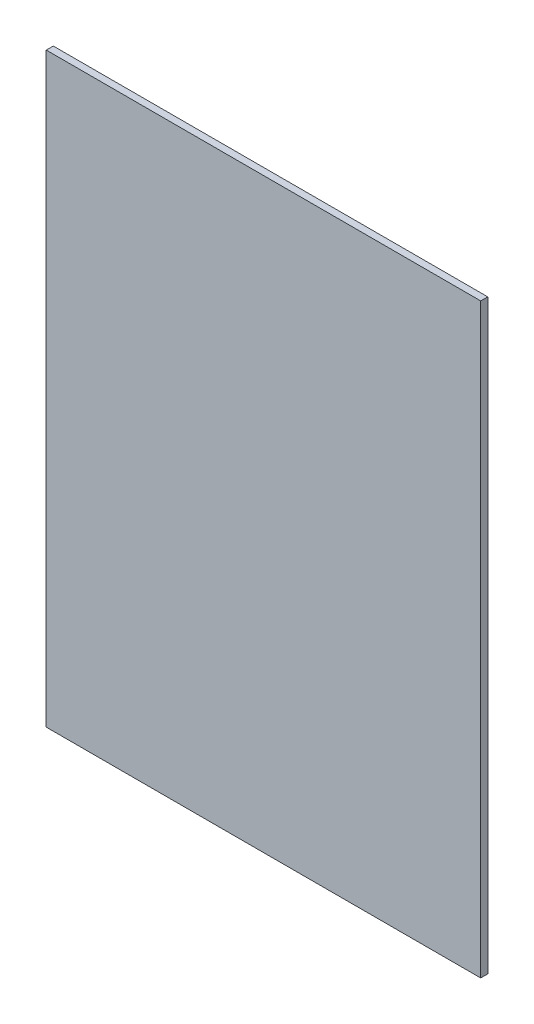
ISO-10303-21;
HEADER;
FILE_DESCRIPTION(('STEP AP214'),'2;1');
FILE_NAME('part.step','',(''),(''),'','','');
FILE_SCHEMA(('AUTOMOTIVE_DESIGN { 1 0 10303 214 1 1 1 1 }'));
ENDSEC;
DATA;
#1=APPLICATION_CONTEXT('core data for automotive mechanical design processes');
#2=APPLICATION_PROTOCOL_DEFINITION('international standard','automotive_design',2000,#1);
#3=PRODUCT_CONTEXT('',#1,'mechanical');
#4=PRODUCT('Part','Part','',(#3));
#5=PRODUCT_RELATED_PRODUCT_CATEGORY('part','',(#4));
#6=PRODUCT_DEFINITION_FORMATION('','',#4);
#7=PRODUCT_DEFINITION_CONTEXT('part definition',#1,'design');
#8=PRODUCT_DEFINITION('design','',#6,#7);
#9=PRODUCT_DEFINITION_SHAPE('','',#8);
#10=(LENGTH_UNIT() NAMED_UNIT(*) SI_UNIT(.MILLI.,.METRE.));
#11=(NAMED_UNIT(*) PLANE_ANGLE_UNIT() SI_UNIT($,.RADIAN.));
#12=(NAMED_UNIT(*) SI_UNIT($,.STERADIAN.) SOLID_ANGLE_UNIT());
#13=UNCERTAINTY_MEASURE_WITH_UNIT(LENGTH_MEASURE(1.E-05),#10,'distance_accuracy_value','');
#14=(GEOMETRIC_REPRESENTATION_CONTEXT(3) GLOBAL_UNCERTAINTY_ASSIGNED_CONTEXT((#13)) GLOBAL_UNIT_ASSIGNED_CONTEXT((#10,
#11,#12)) REPRESENTATION_CONTEXT('',''));
#15=CARTESIAN_POINT('',(0.,0.,0.));
#16=DIRECTION('',(0.,0.,1.));
#17=DIRECTION('',(1.,0.,0.));
#18=AXIS2_PLACEMENT_3D('',#15,#16,#17);
#19=CARTESIAN_POINT('',(0.,0.,1.6));
#20=DIRECTION('',(1.,0.,0.));
#21=DIRECTION('',(0.,0.,-1.));
#22=AXIS2_PLACEMENT_3D('',#19,#20,#21);
#23=PLANE('',#22);
#24=DIRECTION('',(0.,-1.,0.));
#25=VECTOR('',#24,1.);
#26=CARTESIAN_POINT('',(0.,0.,0.));
#27=LINE('',#26,#25);
#28=CARTESIAN_POINT('',(0.,133.40102225,0.));
#29=VERTEX_POINT('',#28);
#30=CARTESIAN_POINT('',(0.,0.,0.));
#31=VERTEX_POINT('',#30);
#32=EDGE_CURVE('E120',#29,#31,#27,.T.);
#33=ORIENTED_EDGE('',*,*,#32,.T.);
#34=DIRECTION('',(0.,0.,-1.));
#35=VECTOR('',#34,1.);
#36=CARTESIAN_POINT('',(0.,0.,1.6));
#37=LINE('',#36,#35);
#38=CARTESIAN_POINT('',(0.,0.,1.6));
#39=VERTEX_POINT('',#38);
#40=EDGE_CURVE('E11',#39,#31,#37,.T.);
#41=ORIENTED_EDGE('',*,*,#40,.F.);
#42=DIRECTION('',(0.,-1.,0.));
#43=VECTOR('',#42,1.);
#44=CARTESIAN_POINT('',(0.,0.,1.6));
#45=LINE('',#44,#43);
#46=CARTESIAN_POINT('',(0.,133.40102225,1.6));
#47=VERTEX_POINT('',#46);
#48=EDGE_CURVE('E102',#47,#39,#45,.T.);
#49=ORIENTED_EDGE('',*,*,#48,.F.);
#50=DIRECTION('',(0.,0.,-1.));
#51=VECTOR('',#50,1.);
#52=CARTESIAN_POINT('',(0.,133.40102225,1.6));
#53=LINE('',#52,#51);
#54=EDGE_CURVE('E116',#47,#29,#53,.T.);
#55=ORIENTED_EDGE('',*,*,#54,.T.);
#56=EDGE_LOOP('',(#33,#41,#49,#55));
#57=FACE_BOUND('',#56,.T.);
#58=ADVANCED_FACE('F49',(#57),#23,.F.);
#59=CARTESIAN_POINT('',(0.,0.,1.6));
#60=DIRECTION('',(0.,1.,0.));
#61=DIRECTION('',(0.,0.,1.));
#62=AXIS2_PLACEMENT_3D('',#59,#60,#61);
#63=PLANE('',#62);
#64=DIRECTION('',(1.,0.,0.));
#65=VECTOR('',#64,1.);
#66=CARTESIAN_POINT('',(0.,0.,0.));
#67=LINE('',#66,#65);
#68=CARTESIAN_POINT('',(98.840202878,0.,0.));
#69=VERTEX_POINT('',#68);
#70=EDGE_CURVE('E107',#31,#69,#67,.T.);
#71=ORIENTED_EDGE('',*,*,#70,.T.);
#72=DIRECTION('',(0.,0.,-1.));
#73=VECTOR('',#72,1.);
#74=CARTESIAN_POINT('',(98.840202878,0.,1.6));
#75=LINE('',#74,#73);
#76=CARTESIAN_POINT('',(98.840202878,0.,1.6));
#77=VERTEX_POINT('',#76);
#78=EDGE_CURVE('E57',#77,#69,#75,.T.);
#79=ORIENTED_EDGE('',*,*,#78,.F.);
#80=DIRECTION('',(1.,0.,0.));
#81=VECTOR('',#80,1.);
#82=CARTESIAN_POINT('',(0.,0.,1.6));
#83=LINE('',#82,#81);
#84=EDGE_CURVE('E96',#39,#77,#83,.T.);
#85=ORIENTED_EDGE('',*,*,#84,.F.);
#86=ORIENTED_EDGE('',*,*,#40,.T.);
#87=EDGE_LOOP('',(#71,#79,#85,#86));
#88=FACE_BOUND('',#87,.T.);
#89=ADVANCED_FACE('F106',(#88),#63,.F.);
#90=CARTESIAN_POINT('',(98.840202878,0.,1.6));
#91=DIRECTION('',(-1.,0.,0.));
#92=DIRECTION('',(0.,0.,1.));
#93=AXIS2_PLACEMENT_3D('',#90,#91,#92);
#94=PLANE('',#93);
#95=DIRECTION('',(0.,1.,0.));
#96=VECTOR('',#95,1.);
#97=CARTESIAN_POINT('',(98.840202878,0.,0.));
#98=LINE('',#97,#96);
#99=CARTESIAN_POINT('',(98.840202878,133.40102225,0.));
#100=VERTEX_POINT('',#99);
#101=EDGE_CURVE('E83',#69,#100,#98,.T.);
#102=ORIENTED_EDGE('',*,*,#101,.T.);
#103=DIRECTION('',(0.,0.,-1.));
#104=VECTOR('',#103,1.);
#105=CARTESIAN_POINT('',(98.840202878,133.40102225,1.6));
#106=LINE('',#105,#104);
#107=CARTESIAN_POINT('',(98.840202878,133.40102225,1.6));
#108=VERTEX_POINT('',#107);
#109=EDGE_CURVE('E109',#108,#100,#106,.T.);
#110=ORIENTED_EDGE('',*,*,#109,.F.);
#111=DIRECTION('',(0.,1.,0.));
#112=VECTOR('',#111,1.);
#113=CARTESIAN_POINT('',(98.840202878,0.,1.6));
#114=LINE('',#113,#112);
#115=EDGE_CURVE('E100',#77,#108,#114,.T.);
#116=ORIENTED_EDGE('',*,*,#115,.F.);
#117=ORIENTED_EDGE('',*,*,#78,.T.);
#118=EDGE_LOOP('',(#102,#110,#116,#117));
#119=FACE_BOUND('',#118,.T.);
#120=ADVANCED_FACE('F110',(#119),#94,.F.);
#121=CARTESIAN_POINT('',(0.,133.40102225,1.6));
#122=DIRECTION('',(0.,-1.,0.));
#123=DIRECTION('',(0.,0.,-1.));
#124=AXIS2_PLACEMENT_3D('',#121,#122,#123);
#125=PLANE('',#124);
#126=DIRECTION('',(-1.,0.,0.));
#127=VECTOR('',#126,1.);
#128=CARTESIAN_POINT('',(0.,133.40102225,0.));
#129=LINE('',#128,#127);
#130=EDGE_CURVE('E89',#100,#29,#129,.T.);
#131=ORIENTED_EDGE('',*,*,#130,.T.);
#132=ORIENTED_EDGE('',*,*,#54,.F.);
#133=DIRECTION('',(-1.,0.,0.));
#134=VECTOR('',#133,1.);
#135=CARTESIAN_POINT('',(0.,133.40102225,1.6));
#136=LINE('',#135,#134);
#137=EDGE_CURVE('E65',#108,#47,#136,.T.);
#138=ORIENTED_EDGE('',*,*,#137,.F.);
#139=ORIENTED_EDGE('',*,*,#109,.T.);
#140=EDGE_LOOP('',(#131,#132,#138,#139));
#141=FACE_BOUND('',#140,.T.);
#142=ADVANCED_FACE('F130',(#141),#125,.F.);
#143=CARTESIAN_POINT('',(0.,0.,1.6));
#144=DIRECTION('',(0.,0.,-1.));
#145=DIRECTION('',(-1.,0.,0.));
#146=AXIS2_PLACEMENT_3D('',#143,#144,#145);
#147=PLANE('',#146);
#148=ORIENTED_EDGE('',*,*,#48,.T.);
#149=ORIENTED_EDGE('',*,*,#84,.T.);
#150=ORIENTED_EDGE('',*,*,#115,.T.);
#151=ORIENTED_EDGE('',*,*,#137,.T.);
#152=EDGE_LOOP('',(#148,#149,#150,#151));
#153=FACE_BOUND('',#152,.T.);
#154=ADVANCED_FACE('F98',(#153),#147,.F.);
#155=CARTESIAN_POINT('',(0.,0.,0.));
#156=DIRECTION('',(0.,0.,-1.));
#157=DIRECTION('',(-1.,0.,0.));
#158=AXIS2_PLACEMENT_3D('',#155,#156,#157);
#159=PLANE('',#158);
#160=ORIENTED_EDGE('',*,*,#32,.F.);
#161=ORIENTED_EDGE('',*,*,#130,.F.);
#162=ORIENTED_EDGE('',*,*,#101,.F.);
#163=ORIENTED_EDGE('',*,*,#70,.F.);
#164=EDGE_LOOP('',(#160,#161,#162,#163));
#165=FACE_BOUND('',#164,.T.);
#166=ADVANCED_FACE('F133',(#165),#159,.T.);
#167=CLOSED_SHELL('',(#58,#89,#120,#142,#154,#166));
#168=MANIFOLD_SOLID_BREP('B2',#167);
#169=ADVANCED_BREP_SHAPE_REPRESENTATION('',(#18,#168),#14);
#170=SHAPE_DEFINITION_REPRESENTATION(#9,#169);
ENDSEC;
END-ISO-10303-21;
